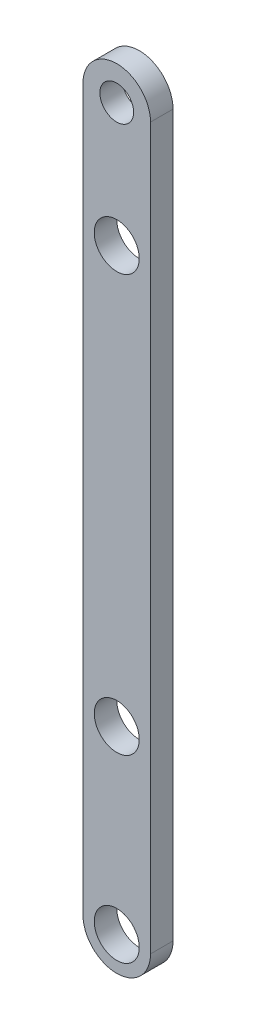
ISO-10303-21;
HEADER;
FILE_DESCRIPTION(('STEP AP214'),'2;1');
FILE_NAME('part.step','',(''),(''),'','','');
FILE_SCHEMA(('AUTOMOTIVE_DESIGN { 1 0 10303 214 1 1 1 1 }'));
ENDSEC;
DATA;
#1=APPLICATION_CONTEXT('core data for automotive mechanical design processes');
#2=APPLICATION_PROTOCOL_DEFINITION('international standard','automotive_design',2000,#1);
#3=PRODUCT_CONTEXT('',#1,'mechanical');
#4=PRODUCT('Part','Part','',(#3));
#5=PRODUCT_RELATED_PRODUCT_CATEGORY('part','',(#4));
#6=PRODUCT_DEFINITION_FORMATION('','',#4);
#7=PRODUCT_DEFINITION_CONTEXT('part definition',#1,'design');
#8=PRODUCT_DEFINITION('design','',#6,#7);
#9=PRODUCT_DEFINITION_SHAPE('','',#8);
#10=(LENGTH_UNIT() NAMED_UNIT(*) SI_UNIT(.MILLI.,.METRE.));
#11=(NAMED_UNIT(*) PLANE_ANGLE_UNIT() SI_UNIT($,.RADIAN.));
#12=(NAMED_UNIT(*) SI_UNIT($,.STERADIAN.) SOLID_ANGLE_UNIT());
#13=UNCERTAINTY_MEASURE_WITH_UNIT(LENGTH_MEASURE(1.E-05),#10,'distance_accuracy_value','');
#14=(GEOMETRIC_REPRESENTATION_CONTEXT(3) GLOBAL_UNCERTAINTY_ASSIGNED_CONTEXT((#13)) GLOBAL_UNIT_ASSIGNED_CONTEXT((#10,
#11,#12)) REPRESENTATION_CONTEXT('',''));
#15=CARTESIAN_POINT('',(0.,0.,0.));
#16=DIRECTION('',(0.,0.,1.));
#17=DIRECTION('',(1.,0.,0.));
#18=AXIS2_PLACEMENT_3D('',#15,#16,#17);
#19=CARTESIAN_POINT('',(0.,16.,1.));
#20=DIRECTION('',(0.,0.,1.));
#21=DIRECTION('',(1.,0.,0.));
#22=AXIS2_PLACEMENT_3D('',#19,#20,#21);
#23=PLANE('',#22);
#24=CARTESIAN_POINT('',(0.,10.5,1.));
#25=DIRECTION('',(0.,0.,1.));
#26=DIRECTION('',(1.,0.,0.));
#27=AXIS2_PLACEMENT_3D('',#24,#25,#26);
#28=CIRCLE('',#27,1.);
#29=CARTESIAN_POINT('',(1.,10.5,1.));
#30=VERTEX_POINT('',#29);
#31=EDGE_CURVE('E122',#30,#30,#28,.T.);
#32=ORIENTED_EDGE('',*,*,#31,.F.);
#33=EDGE_LOOP('',(#32));
#34=FACE_BOUND('',#33,.T.);
#35=CARTESIAN_POINT('',(0.,16.,1.));
#36=DIRECTION('',(0.,0.,1.));
#37=DIRECTION('',(1.,0.,0.));
#38=AXIS2_PLACEMENT_3D('',#35,#36,#37);
#39=CIRCLE('',#38,0.75);
#40=CARTESIAN_POINT('',(0.750000000000004,16.,1.));
#41=VERTEX_POINT('',#40);
#42=EDGE_CURVE('E101',#41,#41,#39,.T.);
#43=ORIENTED_EDGE('',*,*,#42,.F.);
#44=EDGE_LOOP('',(#43));
#45=FACE_BOUND('',#44,.T.);
#46=CARTESIAN_POINT('',(0.,16.,1.));
#47=DIRECTION('',(0.,0.,1.));
#48=DIRECTION('',(1.,0.,0.));
#49=AXIS2_PLACEMENT_3D('',#46,#47,#48);
#50=CIRCLE('',#49,1.5);
#51=CARTESIAN_POINT('',(1.50000000000001,16.,1.));
#52=VERTEX_POINT('',#51);
#53=CARTESIAN_POINT('',(-1.5,16.,1.));
#54=VERTEX_POINT('',#53);
#55=EDGE_CURVE('E86',#52,#54,#50,.T.);
#56=ORIENTED_EDGE('',*,*,#55,.T.);
#57=DIRECTION('',(0.,-1.,0.));
#58=VECTOR('',#57,1.);
#59=CARTESIAN_POINT('',(-1.5,16.,1.));
#60=LINE('',#59,#58);
#61=CARTESIAN_POINT('',(-1.5,-16.,1.));
#62=VERTEX_POINT('',#61);
#63=EDGE_CURVE('E81',#54,#62,#60,.T.);
#64=ORIENTED_EDGE('',*,*,#63,.T.);
#65=CARTESIAN_POINT('',(0.,-16.,1.));
#66=DIRECTION('',(0.,0.,1.));
#67=DIRECTION('',(1.,0.,0.));
#68=AXIS2_PLACEMENT_3D('',#65,#66,#67);
#69=CIRCLE('',#68,1.5);
#70=CARTESIAN_POINT('',(1.50000000000001,-16.,1.));
#71=VERTEX_POINT('',#70);
#72=EDGE_CURVE('E84',#62,#71,#69,.T.);
#73=ORIENTED_EDGE('',*,*,#72,.T.);
#74=DIRECTION('',(0.,1.,0.));
#75=VECTOR('',#74,1.);
#76=CARTESIAN_POINT('',(1.50000000000001,16.,1.));
#77=LINE('',#76,#75);
#78=EDGE_CURVE('E51',#71,#52,#77,.T.);
#79=ORIENTED_EDGE('',*,*,#78,.T.);
#80=EDGE_LOOP('',(#56,#64,#73,#79));
#81=FACE_BOUND('',#80,.T.);
#82=CARTESIAN_POINT('',(0.,-16.,1.));
#83=DIRECTION('',(0.,0.,1.));
#84=DIRECTION('',(1.,0.,0.));
#85=AXIS2_PLACEMENT_3D('',#82,#83,#84);
#86=CIRCLE('',#85,1.);
#87=CARTESIAN_POINT('',(1.00000000000001,-16.,1.));
#88=VERTEX_POINT('',#87);
#89=EDGE_CURVE('E116',#88,#88,#86,.T.);
#90=ORIENTED_EDGE('',*,*,#89,.F.);
#91=EDGE_LOOP('',(#90));
#92=FACE_BOUND('',#91,.T.);
#93=CARTESIAN_POINT('',(0.,-8.,1.));
#94=DIRECTION('',(0.,0.,1.));
#95=DIRECTION('',(1.,0.,0.));
#96=AXIS2_PLACEMENT_3D('',#93,#94,#95);
#97=CIRCLE('',#96,1.);
#98=CARTESIAN_POINT('',(1.00000000000001,-8.,1.));
#99=VERTEX_POINT('',#98);
#100=EDGE_CURVE('E128',#99,#99,#97,.T.);
#101=ORIENTED_EDGE('',*,*,#100,.F.);
#102=EDGE_LOOP('',(#101));
#103=FACE_BOUND('',#102,.T.);
#104=ADVANCED_FACE('F34',(#34,#45,#81,#92,#103),#23,.T.);
#105=CARTESIAN_POINT('',(0.,16.,0.));
#106=DIRECTION('',(0.,0.,1.));
#107=DIRECTION('',(1.,0.,0.));
#108=AXIS2_PLACEMENT_3D('',#105,#106,#107);
#109=PLANE('',#108);
#110=CARTESIAN_POINT('',(0.,16.,0.));
#111=DIRECTION('',(0.,0.,1.));
#112=DIRECTION('',(1.,0.,0.));
#113=AXIS2_PLACEMENT_3D('',#110,#111,#112);
#114=CIRCLE('',#113,1.5);
#115=CARTESIAN_POINT('',(1.50000000000001,16.,0.));
#116=VERTEX_POINT('',#115);
#117=CARTESIAN_POINT('',(-1.5,16.,0.));
#118=VERTEX_POINT('',#117);
#119=EDGE_CURVE('E98',#116,#118,#114,.T.);
#120=ORIENTED_EDGE('',*,*,#119,.F.);
#121=DIRECTION('',(0.,1.,0.));
#122=VECTOR('',#121,1.);
#123=CARTESIAN_POINT('',(1.50000000000001,16.,0.));
#124=LINE('',#123,#122);
#125=CARTESIAN_POINT('',(1.50000000000001,-16.,0.));
#126=VERTEX_POINT('',#125);
#127=EDGE_CURVE('E74',#126,#116,#124,.T.);
#128=ORIENTED_EDGE('',*,*,#127,.F.);
#129=CARTESIAN_POINT('',(0.,-16.,0.));
#130=DIRECTION('',(0.,0.,1.));
#131=DIRECTION('',(1.,0.,0.));
#132=AXIS2_PLACEMENT_3D('',#129,#130,#131);
#133=CIRCLE('',#132,1.5);
#134=CARTESIAN_POINT('',(-1.5,-16.,0.));
#135=VERTEX_POINT('',#134);
#136=EDGE_CURVE('E68',#135,#126,#133,.T.);
#137=ORIENTED_EDGE('',*,*,#136,.F.);
#138=DIRECTION('',(0.,-1.,0.));
#139=VECTOR('',#138,1.);
#140=CARTESIAN_POINT('',(-1.5,16.,0.));
#141=LINE('',#140,#139);
#142=EDGE_CURVE('E90',#118,#135,#141,.T.);
#143=ORIENTED_EDGE('',*,*,#142,.F.);
#144=EDGE_LOOP('',(#120,#128,#137,#143));
#145=FACE_BOUND('',#144,.T.);
#146=CARTESIAN_POINT('',(0.,16.,0.));
#147=DIRECTION('',(0.,0.,1.));
#148=DIRECTION('',(1.,0.,0.));
#149=AXIS2_PLACEMENT_3D('',#146,#147,#148);
#150=CIRCLE('',#149,0.75);
#151=CARTESIAN_POINT('',(0.750000000000004,16.,0.));
#152=VERTEX_POINT('',#151);
#153=EDGE_CURVE('E113',#152,#152,#150,.T.);
#154=ORIENTED_EDGE('',*,*,#153,.T.);
#155=EDGE_LOOP('',(#154));
#156=FACE_BOUND('',#155,.T.);
#157=CARTESIAN_POINT('',(0.,-16.,0.));
#158=DIRECTION('',(0.,0.,1.));
#159=DIRECTION('',(1.,0.,0.));
#160=AXIS2_PLACEMENT_3D('',#157,#158,#159);
#161=CIRCLE('',#160,1.);
#162=CARTESIAN_POINT('',(1.00000000000001,-16.,0.));
#163=VERTEX_POINT('',#162);
#164=EDGE_CURVE('E119',#163,#163,#161,.T.);
#165=ORIENTED_EDGE('',*,*,#164,.T.);
#166=EDGE_LOOP('',(#165));
#167=FACE_BOUND('',#166,.T.);
#168=CARTESIAN_POINT('',(0.,10.5,0.));
#169=DIRECTION('',(0.,0.,1.));
#170=DIRECTION('',(1.,0.,0.));
#171=AXIS2_PLACEMENT_3D('',#168,#169,#170);
#172=CIRCLE('',#171,1.);
#173=CARTESIAN_POINT('',(1.,10.5,0.));
#174=VERTEX_POINT('',#173);
#175=EDGE_CURVE('E125',#174,#174,#172,.T.);
#176=ORIENTED_EDGE('',*,*,#175,.T.);
#177=EDGE_LOOP('',(#176));
#178=FACE_BOUND('',#177,.T.);
#179=CARTESIAN_POINT('',(0.,-8.,0.));
#180=DIRECTION('',(0.,0.,1.));
#181=DIRECTION('',(1.,0.,0.));
#182=AXIS2_PLACEMENT_3D('',#179,#180,#181);
#183=CIRCLE('',#182,1.);
#184=CARTESIAN_POINT('',(1.00000000000001,-8.,0.));
#185=VERTEX_POINT('',#184);
#186=EDGE_CURVE('E131',#185,#185,#183,.T.);
#187=ORIENTED_EDGE('',*,*,#186,.T.);
#188=EDGE_LOOP('',(#187));
#189=FACE_BOUND('',#188,.T.);
#190=ADVANCED_FACE('F109',(#145,#156,#167,#178,#189),#109,.F.);
#191=CARTESIAN_POINT('',(0.,16.,1.));
#192=DIRECTION('',(0.,0.,-1.));
#193=DIRECTION('',(-1.,0.,0.));
#194=AXIS2_PLACEMENT_3D('',#191,#192,#193);
#195=CYLINDRICAL_SURFACE('',#194,1.5);
#196=ORIENTED_EDGE('',*,*,#119,.T.);
#197=DIRECTION('',(0.,0.,-1.));
#198=VECTOR('',#197,1.);
#199=CARTESIAN_POINT('',(-1.5,16.,1.));
#200=LINE('',#199,#198);
#201=EDGE_CURVE('E11',#54,#118,#200,.T.);
#202=ORIENTED_EDGE('',*,*,#201,.F.);
#203=ORIENTED_EDGE('',*,*,#55,.F.);
#204=DIRECTION('',(0.,0.,-1.));
#205=VECTOR('',#204,1.);
#206=CARTESIAN_POINT('',(1.50000000000001,16.,1.));
#207=LINE('',#206,#205);
#208=EDGE_CURVE('E94',#52,#116,#207,.T.);
#209=ORIENTED_EDGE('',*,*,#208,.T.);
#210=EDGE_LOOP('',(#196,#202,#203,#209));
#211=FACE_BOUND('',#210,.T.);
#212=ADVANCED_FACE('F36',(#211),#195,.T.);
#213=CARTESIAN_POINT('',(-1.5,16.,1.));
#214=DIRECTION('',(1.,0.,0.));
#215=DIRECTION('',(0.,0.,-1.));
#216=AXIS2_PLACEMENT_3D('',#213,#214,#215);
#217=PLANE('',#216);
#218=ORIENTED_EDGE('',*,*,#142,.T.);
#219=DIRECTION('',(0.,0.,-1.));
#220=VECTOR('',#219,1.);
#221=CARTESIAN_POINT('',(-1.5,-16.,1.));
#222=LINE('',#221,#220);
#223=EDGE_CURVE('E43',#62,#135,#222,.T.);
#224=ORIENTED_EDGE('',*,*,#223,.F.);
#225=ORIENTED_EDGE('',*,*,#63,.F.);
#226=ORIENTED_EDGE('',*,*,#201,.T.);
#227=EDGE_LOOP('',(#218,#224,#225,#226));
#228=FACE_BOUND('',#227,.T.);
#229=ADVANCED_FACE('F89',(#228),#217,.F.);
#230=CARTESIAN_POINT('',(0.,-16.,1.));
#231=DIRECTION('',(0.,0.,-1.));
#232=DIRECTION('',(-1.,0.,0.));
#233=AXIS2_PLACEMENT_3D('',#230,#231,#232);
#234=CYLINDRICAL_SURFACE('',#233,1.5);
#235=ORIENTED_EDGE('',*,*,#136,.T.);
#236=DIRECTION('',(0.,0.,-1.));
#237=VECTOR('',#236,1.);
#238=CARTESIAN_POINT('',(1.50000000000001,-16.,1.));
#239=LINE('',#238,#237);
#240=EDGE_CURVE('E91',#71,#126,#239,.T.);
#241=ORIENTED_EDGE('',*,*,#240,.F.);
#242=ORIENTED_EDGE('',*,*,#72,.F.);
#243=ORIENTED_EDGE('',*,*,#223,.T.);
#244=EDGE_LOOP('',(#235,#241,#242,#243));
#245=FACE_BOUND('',#244,.T.);
#246=ADVANCED_FACE('F92',(#245),#234,.T.);
#247=CARTESIAN_POINT('',(1.50000000000001,16.,1.));
#248=DIRECTION('',(-1.,0.,0.));
#249=DIRECTION('',(0.,0.,1.));
#250=AXIS2_PLACEMENT_3D('',#247,#248,#249);
#251=PLANE('',#250);
#252=ORIENTED_EDGE('',*,*,#127,.T.);
#253=ORIENTED_EDGE('',*,*,#208,.F.);
#254=ORIENTED_EDGE('',*,*,#78,.F.);
#255=ORIENTED_EDGE('',*,*,#240,.T.);
#256=EDGE_LOOP('',(#252,#253,#254,#255));
#257=FACE_BOUND('',#256,.T.);
#258=ADVANCED_FACE('F106',(#257),#251,.F.);
#259=CARTESIAN_POINT('',(0.,16.,1.));
#260=DIRECTION('',(0.,0.,-1.));
#261=DIRECTION('',(-1.,0.,0.));
#262=AXIS2_PLACEMENT_3D('',#259,#260,#261);
#263=CYLINDRICAL_SURFACE('',#262,0.75);
#264=ORIENTED_EDGE('',*,*,#42,.T.);
#265=EDGE_LOOP('',(#264));
#266=FACE_BOUND('',#265,.T.);
#267=ORIENTED_EDGE('',*,*,#153,.F.);
#268=EDGE_LOOP('',(#267));
#269=FACE_BOUND('',#268,.T.);
#270=ADVANCED_FACE('F150',(#266,#269),#263,.F.);
#271=CARTESIAN_POINT('',(0.,-16.,1.));
#272=DIRECTION('',(0.,0.,-1.));
#273=DIRECTION('',(-1.,0.,0.));
#274=AXIS2_PLACEMENT_3D('',#271,#272,#273);
#275=CYLINDRICAL_SURFACE('',#274,1.);
#276=ORIENTED_EDGE('',*,*,#89,.T.);
#277=EDGE_LOOP('',(#276));
#278=FACE_BOUND('',#277,.T.);
#279=ORIENTED_EDGE('',*,*,#164,.F.);
#280=EDGE_LOOP('',(#279));
#281=FACE_BOUND('',#280,.T.);
#282=ADVANCED_FACE('F196',(#278,#281),#275,.F.);
#283=CARTESIAN_POINT('',(0.,10.5,1.));
#284=DIRECTION('',(0.,0.,-1.));
#285=DIRECTION('',(-1.,0.,0.));
#286=AXIS2_PLACEMENT_3D('',#283,#284,#285);
#287=CYLINDRICAL_SURFACE('',#286,1.);
#288=ORIENTED_EDGE('',*,*,#31,.T.);
#289=EDGE_LOOP('',(#288));
#290=FACE_BOUND('',#289,.T.);
#291=ORIENTED_EDGE('',*,*,#175,.F.);
#292=EDGE_LOOP('',(#291));
#293=FACE_BOUND('',#292,.T.);
#294=ADVANCED_FACE('F204',(#290,#293),#287,.F.);
#295=CARTESIAN_POINT('',(0.,-8.,1.));
#296=DIRECTION('',(0.,0.,-1.));
#297=DIRECTION('',(-1.,0.,0.));
#298=AXIS2_PLACEMENT_3D('',#295,#296,#297);
#299=CYLINDRICAL_SURFACE('',#298,1.);
#300=ORIENTED_EDGE('',*,*,#100,.T.);
#301=EDGE_LOOP('',(#300));
#302=FACE_BOUND('',#301,.T.);
#303=ORIENTED_EDGE('',*,*,#186,.F.);
#304=EDGE_LOOP('',(#303));
#305=FACE_BOUND('',#304,.T.);
#306=ADVANCED_FACE('F137',(#302,#305),#299,.F.);
#307=CLOSED_SHELL('',(#104,#190,#212,#229,#246,#258,#270,#282,#294,#306));
#308=MANIFOLD_SOLID_BREP('B2',#307);
#309=ADVANCED_BREP_SHAPE_REPRESENTATION('',(#18,#308),#14);
#310=SHAPE_DEFINITION_REPRESENTATION(#9,#309);
ENDSEC;
END-ISO-10303-21;
